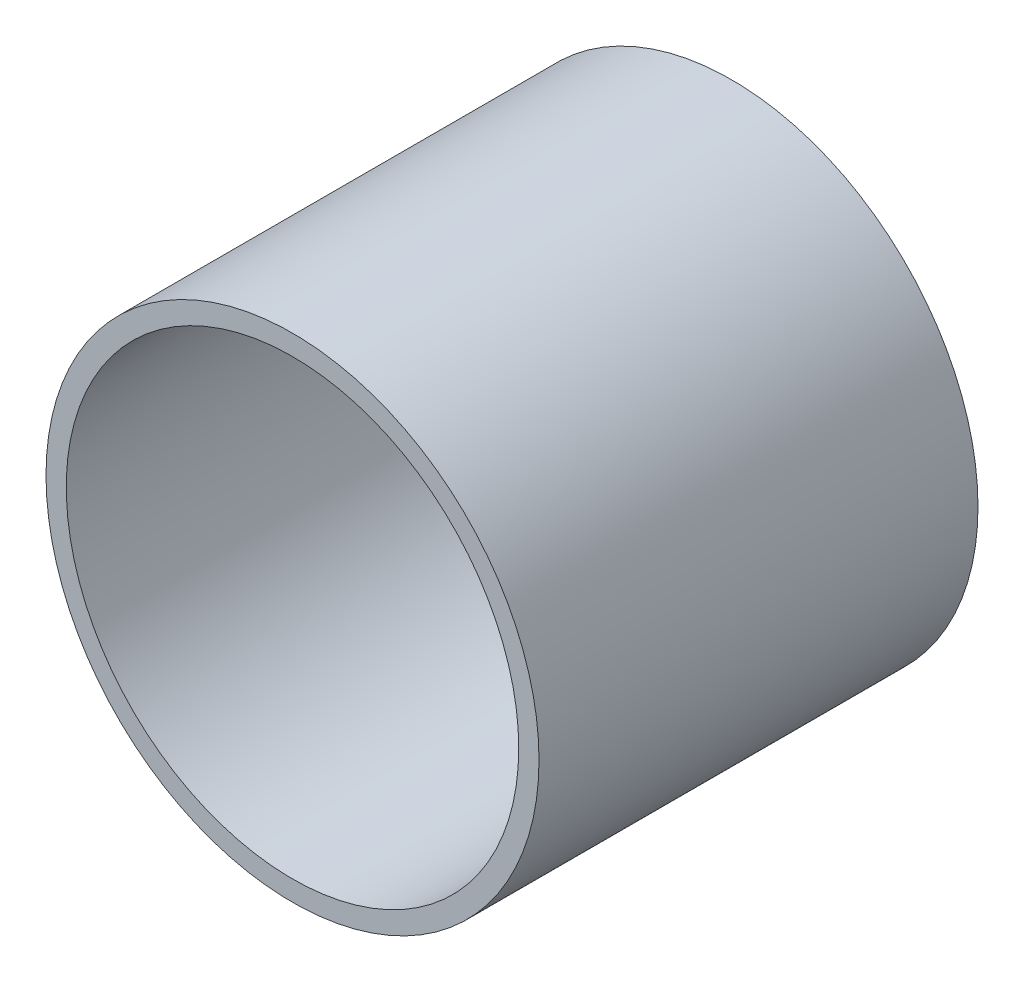
ISO-10303-21;
HEADER;
FILE_DESCRIPTION(('STEP AP214'),'2;1');
FILE_NAME('part.step','',(''),(''),'','','');
FILE_SCHEMA(('AUTOMOTIVE_DESIGN { 1 0 10303 214 1 1 1 1 }'));
ENDSEC;
DATA;
#1=APPLICATION_CONTEXT('core data for automotive mechanical design processes');
#2=APPLICATION_PROTOCOL_DEFINITION('international standard','automotive_design',2000,#1);
#3=PRODUCT_CONTEXT('',#1,'mechanical');
#4=PRODUCT('Part','Part','',(#3));
#5=PRODUCT_RELATED_PRODUCT_CATEGORY('part','',(#4));
#6=PRODUCT_DEFINITION_FORMATION('','',#4);
#7=PRODUCT_DEFINITION_CONTEXT('part definition',#1,'design');
#8=PRODUCT_DEFINITION('design','',#6,#7);
#9=PRODUCT_DEFINITION_SHAPE('','',#8);
#10=(LENGTH_UNIT() NAMED_UNIT(*) SI_UNIT(.MILLI.,.METRE.));
#11=(NAMED_UNIT(*) PLANE_ANGLE_UNIT() SI_UNIT($,.RADIAN.));
#12=(NAMED_UNIT(*) SI_UNIT($,.STERADIAN.) SOLID_ANGLE_UNIT());
#13=UNCERTAINTY_MEASURE_WITH_UNIT(LENGTH_MEASURE(1.E-05),#10,'distance_accuracy_value','');
#14=(GEOMETRIC_REPRESENTATION_CONTEXT(3) GLOBAL_UNCERTAINTY_ASSIGNED_CONTEXT((#13)) GLOBAL_UNIT_ASSIGNED_CONTEXT((#10,
#11,#12)) REPRESENTATION_CONTEXT('',''));
#15=CARTESIAN_POINT('',(0.,0.,0.));
#16=DIRECTION('',(0.,0.,1.));
#17=DIRECTION('',(1.,0.,0.));
#18=AXIS2_PLACEMENT_3D('',#15,#16,#17);
#19=CARTESIAN_POINT('',(0.,0.,65.));
#20=DIRECTION('',(0.,0.,1.));
#21=DIRECTION('',(1.,0.,0.));
#22=AXIS2_PLACEMENT_3D('',#19,#20,#21);
#23=PLANE('',#22);
#24=CARTESIAN_POINT('',(0.,0.,65.));
#25=DIRECTION('',(0.,0.,1.));
#26=DIRECTION('',(1.,0.,0.));
#27=AXIS2_PLACEMENT_3D('',#24,#25,#26);
#28=CIRCLE('',#27,36.5);
#29=CARTESIAN_POINT('',(36.5,0.,65.));
#30=VERTEX_POINT('',#29);
#31=EDGE_CURVE('E38',#30,#30,#28,.T.);
#32=ORIENTED_EDGE('',*,*,#31,.T.);
#33=EDGE_LOOP('',(#32));
#34=FACE_BOUND('',#33,.T.);
#35=CARTESIAN_POINT('',(0.,0.,65.));
#36=DIRECTION('',(0.,0.,1.));
#37=DIRECTION('',(1.,0.,0.));
#38=AXIS2_PLACEMENT_3D('',#35,#36,#37);
#39=CIRCLE('',#38,33.5);
#40=CARTESIAN_POINT('',(33.5,0.,65.));
#41=VERTEX_POINT('',#40);
#42=EDGE_CURVE('E47',#41,#41,#39,.T.);
#43=ORIENTED_EDGE('',*,*,#42,.F.);
#44=EDGE_LOOP('',(#43));
#45=FACE_BOUND('',#44,.T.);
#46=ADVANCED_FACE('F31',(#34,#45),#23,.T.);
#47=CARTESIAN_POINT('',(0.,0.,0.));
#48=DIRECTION('',(0.,0.,1.));
#49=DIRECTION('',(1.,0.,0.));
#50=AXIS2_PLACEMENT_3D('',#47,#48,#49);
#51=PLANE('',#50);
#52=CARTESIAN_POINT('',(0.,0.,0.));
#53=DIRECTION('',(0.,0.,1.));
#54=DIRECTION('',(1.,0.,0.));
#55=AXIS2_PLACEMENT_3D('',#52,#53,#54);
#56=CIRCLE('',#55,36.5);
#57=CARTESIAN_POINT('',(36.5,0.,0.));
#58=VERTEX_POINT('',#57);
#59=EDGE_CURVE('E42',#58,#58,#56,.T.);
#60=ORIENTED_EDGE('',*,*,#59,.F.);
#61=EDGE_LOOP('',(#60));
#62=FACE_BOUND('',#61,.T.);
#63=ADVANCED_FACE('F55',(#62),#51,.F.);
#64=CARTESIAN_POINT('',(0.,0.,65.));
#65=DIRECTION('',(0.,0.,-1.));
#66=DIRECTION('',(-1.,0.,0.));
#67=AXIS2_PLACEMENT_3D('',#64,#65,#66);
#68=CYLINDRICAL_SURFACE('',#67,36.5);
#69=ORIENTED_EDGE('',*,*,#31,.F.);
#70=EDGE_LOOP('',(#69));
#71=FACE_BOUND('',#70,.T.);
#72=ORIENTED_EDGE('',*,*,#59,.T.);
#73=EDGE_LOOP('',(#72));
#74=FACE_BOUND('',#73,.T.);
#75=ADVANCED_FACE('F33',(#71,#74),#68,.T.);
#76=CARTESIAN_POINT('',(0.,0.,65.));
#77=DIRECTION('',(0.,0.,-1.));
#78=DIRECTION('',(-1.,0.,0.));
#79=AXIS2_PLACEMENT_3D('',#76,#77,#78);
#80=CYLINDRICAL_SURFACE('',#79,33.5);
#81=CARTESIAN_POINT('',(0.,0.,3.));
#82=DIRECTION('',(0.,0.,1.));
#83=DIRECTION('',(1.,0.,0.));
#84=AXIS2_PLACEMENT_3D('',#81,#82,#83);
#85=CIRCLE('',#84,33.5);
#86=CARTESIAN_POINT('',(33.5,0.,3.));
#87=VERTEX_POINT('',#86);
#88=EDGE_CURVE('E10',#87,#87,#85,.T.);
#89=ORIENTED_EDGE('',*,*,#88,.F.);
#90=EDGE_LOOP('',(#89));
#91=FACE_BOUND('',#90,.T.);
#92=ORIENTED_EDGE('',*,*,#42,.T.);
#93=EDGE_LOOP('',(#92));
#94=FACE_BOUND('',#93,.T.);
#95=ADVANCED_FACE('F52',(#91,#94),#80,.F.);
#96=CARTESIAN_POINT('',(0.,0.,3.));
#97=DIRECTION('',(0.,0.,1.));
#98=DIRECTION('',(1.,0.,0.));
#99=AXIS2_PLACEMENT_3D('',#96,#97,#98);
#100=PLANE('',#99);
#101=ORIENTED_EDGE('',*,*,#88,.T.);
#102=EDGE_LOOP('',(#101));
#103=FACE_BOUND('',#102,.T.);
#104=ADVANCED_FACE('F64',(#103),#100,.T.);
#105=CLOSED_SHELL('',(#46,#63,#75,#95,#104));
#106=MANIFOLD_SOLID_BREP('B2',#105);
#107=ADVANCED_BREP_SHAPE_REPRESENTATION('',(#18,#106),#14);
#108=SHAPE_DEFINITION_REPRESENTATION(#9,#107);
ENDSEC;
END-ISO-10303-21;
